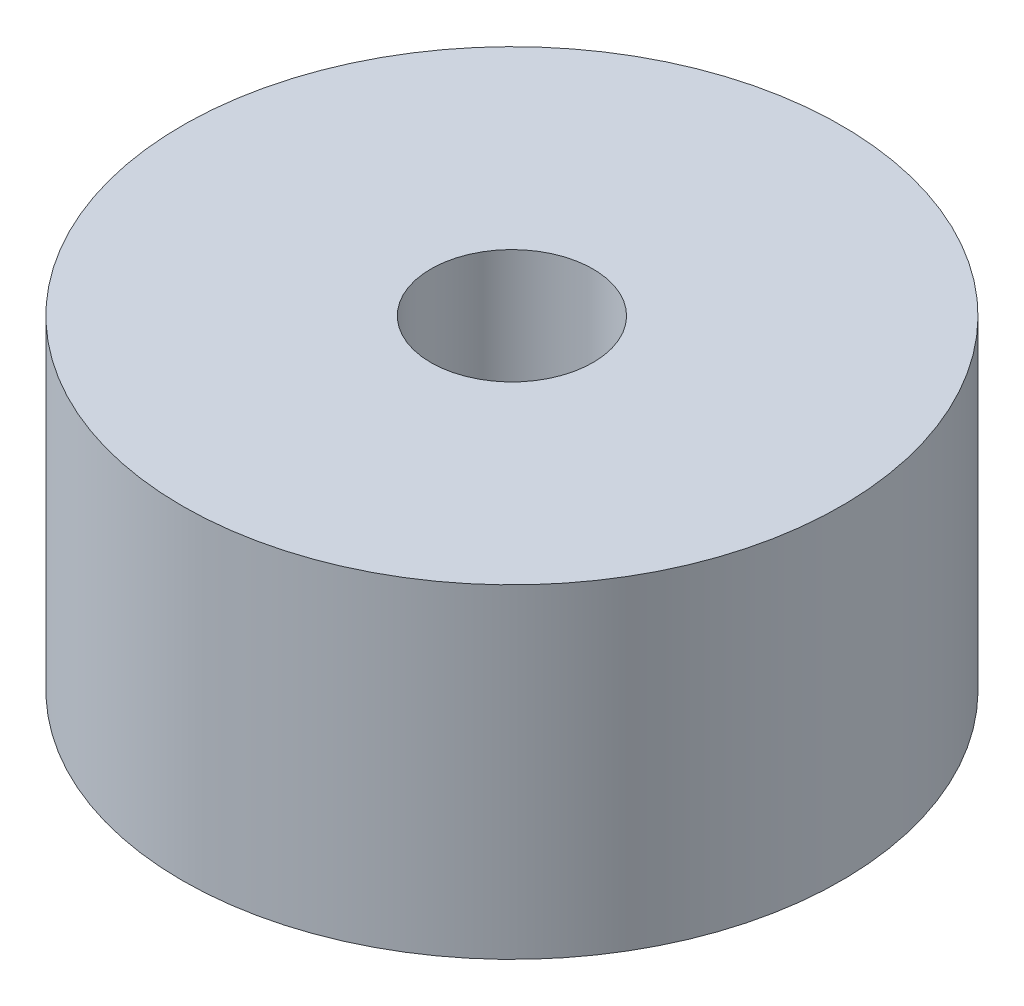
ISO-10303-21;
HEADER;
FILE_DESCRIPTION(('STEP AP214'),'2;1');
FILE_NAME('part.step','',(''),(''),'','','');
FILE_SCHEMA(('AUTOMOTIVE_DESIGN { 1 0 10303 214 1 1 1 1 }'));
ENDSEC;
DATA;
#1=APPLICATION_CONTEXT('core data for automotive mechanical design processes');
#2=APPLICATION_PROTOCOL_DEFINITION('international standard','automotive_design',2000,#1);
#3=PRODUCT_CONTEXT('',#1,'mechanical');
#4=PRODUCT('Part','Part','',(#3));
#5=PRODUCT_RELATED_PRODUCT_CATEGORY('part','',(#4));
#6=PRODUCT_DEFINITION_FORMATION('','',#4);
#7=PRODUCT_DEFINITION_CONTEXT('part definition',#1,'design');
#8=PRODUCT_DEFINITION('design','',#6,#7);
#9=PRODUCT_DEFINITION_SHAPE('','',#8);
#10=(LENGTH_UNIT() NAMED_UNIT(*) SI_UNIT(.MILLI.,.METRE.));
#11=(NAMED_UNIT(*) PLANE_ANGLE_UNIT() SI_UNIT($,.RADIAN.));
#12=(NAMED_UNIT(*) SI_UNIT($,.STERADIAN.) SOLID_ANGLE_UNIT());
#13=UNCERTAINTY_MEASURE_WITH_UNIT(LENGTH_MEASURE(1.E-05),#10,'distance_accuracy_value','');
#14=(GEOMETRIC_REPRESENTATION_CONTEXT(3) GLOBAL_UNCERTAINTY_ASSIGNED_CONTEXT((#13)) GLOBAL_UNIT_ASSIGNED_CONTEXT((#10,
#11,#12)) REPRESENTATION_CONTEXT('',''));
#15=CARTESIAN_POINT('',(0.,0.,0.));
#16=DIRECTION('',(0.,0.,1.));
#17=DIRECTION('',(1.,0.,0.));
#18=AXIS2_PLACEMENT_3D('',#15,#16,#17);
#19=CARTESIAN_POINT('',(0.,6.35,0.));
#20=DIRECTION('',(0.,1.,0.));
#21=DIRECTION('',(0.,0.,1.));
#22=AXIS2_PLACEMENT_3D('',#19,#20,#21);
#23=PLANE('',#22);
#24=CARTESIAN_POINT('',(0.,6.35,0.));
#25=DIRECTION('',(0.,1.,0.));
#26=DIRECTION('',(0.,0.,1.));
#27=AXIS2_PLACEMENT_3D('',#24,#25,#26);
#28=CIRCLE('',#27,6.4516);
#29=CARTESIAN_POINT('',(0.,6.35,6.4516));
#30=VERTEX_POINT('',#29);
#31=EDGE_CURVE('E10',#30,#30,#28,.T.);
#32=ORIENTED_EDGE('',*,*,#31,.T.);
#33=EDGE_LOOP('',(#32));
#34=FACE_BOUND('',#33,.T.);
#35=CARTESIAN_POINT('',(0.,6.35,0.));
#36=DIRECTION('',(0.,1.,0.));
#37=DIRECTION('',(0.,0.,1.));
#38=AXIS2_PLACEMENT_3D('',#35,#36,#37);
#39=CIRCLE('',#38,1.5875);
#40=CARTESIAN_POINT('',(0.,6.35,1.5875));
#41=VERTEX_POINT('',#40);
#42=EDGE_CURVE('E50',#41,#41,#39,.T.);
#43=ORIENTED_EDGE('',*,*,#42,.F.);
#44=EDGE_LOOP('',(#43));
#45=FACE_BOUND('',#44,.T.);
#46=ADVANCED_FACE('F37',(#34,#45),#23,.T.);
#47=CARTESIAN_POINT('',(0.,0.,0.));
#48=DIRECTION('',(0.,1.,0.));
#49=DIRECTION('',(0.,0.,1.));
#50=AXIS2_PLACEMENT_3D('',#47,#48,#49);
#51=PLANE('',#50);
#52=CARTESIAN_POINT('',(0.,0.,0.));
#53=DIRECTION('',(0.,1.,0.));
#54=DIRECTION('',(0.,0.,1.));
#55=AXIS2_PLACEMENT_3D('',#52,#53,#54);
#56=CIRCLE('',#55,6.4516);
#57=CARTESIAN_POINT('',(0.,0.,6.4516));
#58=VERTEX_POINT('',#57);
#59=EDGE_CURVE('E41',#58,#58,#56,.T.);
#60=ORIENTED_EDGE('',*,*,#59,.F.);
#61=EDGE_LOOP('',(#60));
#62=FACE_BOUND('',#61,.T.);
#63=CARTESIAN_POINT('',(0.,0.,0.));
#64=DIRECTION('',(0.,1.,0.));
#65=DIRECTION('',(0.,0.,1.));
#66=AXIS2_PLACEMENT_3D('',#63,#64,#65);
#67=CIRCLE('',#66,1.5875);
#68=CARTESIAN_POINT('',(0.,0.,1.5875));
#69=VERTEX_POINT('',#68);
#70=EDGE_CURVE('E52',#69,#69,#67,.T.);
#71=ORIENTED_EDGE('',*,*,#70,.T.);
#72=EDGE_LOOP('',(#71));
#73=FACE_BOUND('',#72,.T.);
#74=ADVANCED_FACE('F64',(#62,#73),#51,.F.);
#75=CARTESIAN_POINT('',(0.,6.35,0.));
#76=DIRECTION('',(0.,-1.,0.));
#77=DIRECTION('',(0.,0.,-1.));
#78=AXIS2_PLACEMENT_3D('',#75,#76,#77);
#79=CYLINDRICAL_SURFACE('',#78,6.4516);
#80=ORIENTED_EDGE('',*,*,#31,.F.);
#81=EDGE_LOOP('',(#80));
#82=FACE_BOUND('',#81,.T.);
#83=ORIENTED_EDGE('',*,*,#59,.T.);
#84=EDGE_LOOP('',(#83));
#85=FACE_BOUND('',#84,.T.);
#86=ADVANCED_FACE('F39',(#82,#85),#79,.T.);
#87=CARTESIAN_POINT('',(0.,6.35,0.));
#88=DIRECTION('',(0.,-1.,0.));
#89=DIRECTION('',(0.,0.,-1.));
#90=AXIS2_PLACEMENT_3D('',#87,#88,#89);
#91=CYLINDRICAL_SURFACE('',#90,1.5875);
#92=ORIENTED_EDGE('',*,*,#42,.T.);
#93=EDGE_LOOP('',(#92));
#94=FACE_BOUND('',#93,.T.);
#95=ORIENTED_EDGE('',*,*,#70,.F.);
#96=EDGE_LOOP('',(#95));
#97=FACE_BOUND('',#96,.T.);
#98=ADVANCED_FACE('F60',(#94,#97),#91,.F.);
#99=CLOSED_SHELL('',(#46,#74,#86,#98));
#100=MANIFOLD_SOLID_BREP('B2',#99);
#101=ADVANCED_BREP_SHAPE_REPRESENTATION('',(#18,#100),#14);
#102=SHAPE_DEFINITION_REPRESENTATION(#9,#101);
ENDSEC;
END-ISO-10303-21;
